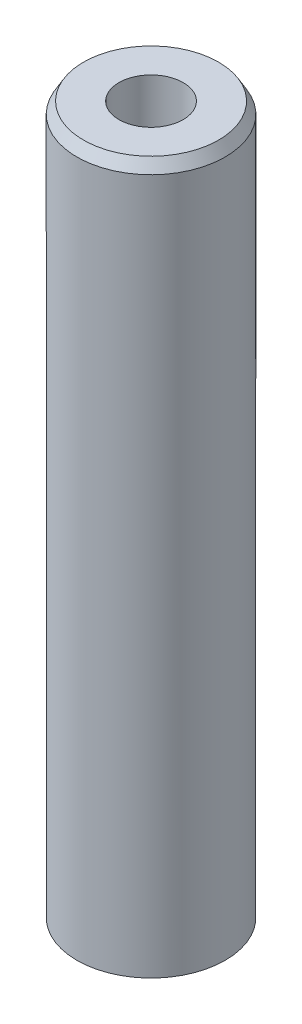
ISO-10303-21;
HEADER;
FILE_DESCRIPTION(('STEP AP214'),'2;1');
FILE_NAME('part.step','',(''),(''),'','','');
FILE_SCHEMA(('AUTOMOTIVE_DESIGN { 1 0 10303 214 1 1 1 1 }'));
ENDSEC;
DATA;
#1=APPLICATION_CONTEXT('core data for automotive mechanical design processes');
#2=APPLICATION_PROTOCOL_DEFINITION('international standard','automotive_design',2000,#1);
#3=PRODUCT_CONTEXT('',#1,'mechanical');
#4=PRODUCT('Part','Part','',(#3));
#5=PRODUCT_RELATED_PRODUCT_CATEGORY('part','',(#4));
#6=PRODUCT_DEFINITION_FORMATION('','',#4);
#7=PRODUCT_DEFINITION_CONTEXT('part definition',#1,'design');
#8=PRODUCT_DEFINITION('design','',#6,#7);
#9=PRODUCT_DEFINITION_SHAPE('','',#8);
#10=(LENGTH_UNIT() NAMED_UNIT(*) SI_UNIT(.MILLI.,.METRE.));
#11=(NAMED_UNIT(*) PLANE_ANGLE_UNIT() SI_UNIT($,.RADIAN.));
#12=(NAMED_UNIT(*) SI_UNIT($,.STERADIAN.) SOLID_ANGLE_UNIT());
#13=UNCERTAINTY_MEASURE_WITH_UNIT(LENGTH_MEASURE(1.E-05),#10,'distance_accuracy_value','');
#14=(GEOMETRIC_REPRESENTATION_CONTEXT(3) GLOBAL_UNCERTAINTY_ASSIGNED_CONTEXT((#13)) GLOBAL_UNIT_ASSIGNED_CONTEXT((#10,
#11,#12)) REPRESENTATION_CONTEXT('',''));
#15=CARTESIAN_POINT('',(0.,0.,0.));
#16=DIRECTION('',(0.,0.,1.));
#17=DIRECTION('',(1.,0.,0.));
#18=AXIS2_PLACEMENT_3D('',#15,#16,#17);
#19=CARTESIAN_POINT('',(0.,48.1345718786471,0.));
#20=DIRECTION('',(0.,-1.,0.));
#21=DIRECTION('',(0.,0.,-1.));
#22=AXIS2_PLACEMENT_3D('',#19,#20,#21);
#23=CYLINDRICAL_SURFACE('',#22,5.);
#24=CARTESIAN_POINT('',(0.,47.3669205132208,0.));
#25=DIRECTION('',(0.,1.,0.));
#26=DIRECTION('',(0.,0.,1.));
#27=AXIS2_PLACEMENT_3D('',#24,#25,#26);
#28=CIRCLE('',#27,5.);
#29=CARTESIAN_POINT('',(0.,47.3669205132208,-5.));
#30=VERTEX_POINT('',#29);
#31=EDGE_CURVE('E50',#30,#30,#28,.F.);
#32=ORIENTED_EDGE('',*,*,#31,.T.);
#33=EDGE_LOOP('',(#32));
#34=FACE_BOUND('',#33,.T.);
#35=CARTESIAN_POINT('',(0.,0.44320372247262,0.));
#36=DIRECTION('',(0.,1.,0.));
#37=DIRECTION('',(0.,0.,1.));
#38=AXIS2_PLACEMENT_3D('',#35,#36,#37);
#39=CIRCLE('',#38,5.);
#40=CARTESIAN_POINT('',(0.,0.44320372247262,5.));
#41=VERTEX_POINT('',#40);
#42=EDGE_CURVE('E51',#41,#41,#39,.T.);
#43=ORIENTED_EDGE('',*,*,#42,.T.);
#44=EDGE_LOOP('',(#43));
#45=FACE_BOUND('',#44,.T.);
#46=ADVANCED_FACE('F39',(#34,#45),#23,.T.);
#47=CARTESIAN_POINT('',(0.,48.1345718786471,0.));
#48=DIRECTION('',(0.,1.,0.));
#49=DIRECTION('',(0.,0.,1.));
#50=AXIS2_PLACEMENT_3D('',#47,#48,#49);
#51=PLANE('',#50);
#52=CARTESIAN_POINT('',(0.,48.1345718786471,0.));
#53=DIRECTION('',(0.,1.,0.));
#54=DIRECTION('',(0.,0.,1.));
#55=AXIS2_PLACEMENT_3D('',#52,#53,#54);
#56=CIRCLE('',#55,4.55679627752738);
#57=CARTESIAN_POINT('',(0.,48.1345718786471,-4.55679627752738));
#58=VERTEX_POINT('',#57);
#59=EDGE_CURVE('E54',#58,#58,#56,.T.);
#60=ORIENTED_EDGE('',*,*,#59,.T.);
#61=EDGE_LOOP('',(#60));
#62=FACE_BOUND('',#61,.T.);
#63=CARTESIAN_POINT('',(0.,48.1345718786471,0.));
#64=DIRECTION('',(0.,1.,0.));
#65=DIRECTION('',(0.,0.,1.));
#66=AXIS2_PLACEMENT_3D('',#63,#64,#65);
#67=CIRCLE('',#66,2.16621518925584);
#68=CARTESIAN_POINT('',(0.,48.1345718786471,2.16621518925584));
#69=VERTEX_POINT('',#68);
#70=EDGE_CURVE('E58',#69,#69,#67,.T.);
#71=ORIENTED_EDGE('',*,*,#70,.F.);
#72=EDGE_LOOP('',(#71));
#73=FACE_BOUND('',#72,.T.);
#74=ADVANCED_FACE('F69',(#62,#73),#51,.T.);
#75=CARTESIAN_POINT('',(0.,0.,0.));
#76=DIRECTION('',(0.,1.,0.));
#77=DIRECTION('',(0.,0.,1.));
#78=AXIS2_PLACEMENT_3D('',#75,#76,#77);
#79=PLANE('',#78);
#80=CARTESIAN_POINT('',(0.,0.,0.));
#81=DIRECTION('',(0.,1.,0.));
#82=DIRECTION('',(0.,0.,1.));
#83=AXIS2_PLACEMENT_3D('',#80,#81,#82);
#84=CIRCLE('',#83,4.23234863457376);
#85=CARTESIAN_POINT('',(0.,0.,4.23234863457376));
#86=VERTEX_POINT('',#85);
#87=EDGE_CURVE('E10',#86,#86,#84,.F.);
#88=ORIENTED_EDGE('',*,*,#87,.T.);
#89=EDGE_LOOP('',(#88));
#90=FACE_BOUND('',#89,.T.);
#91=CARTESIAN_POINT('',(0.,0.,0.));
#92=DIRECTION('',(0.,1.,0.));
#93=DIRECTION('',(0.,0.,1.));
#94=AXIS2_PLACEMENT_3D('',#91,#92,#93);
#95=CIRCLE('',#94,2.16621518925584);
#96=CARTESIAN_POINT('',(0.,0.,2.16621518925584));
#97=VERTEX_POINT('',#96);
#98=EDGE_CURVE('E63',#97,#97,#95,.T.);
#99=ORIENTED_EDGE('',*,*,#98,.T.);
#100=EDGE_LOOP('',(#99));
#101=FACE_BOUND('',#100,.T.);
#102=ADVANCED_FACE('F75',(#90,#101),#79,.F.);
#103=CARTESIAN_POINT('',(0.,48.1345718786471,0.));
#104=DIRECTION('',(0.,-1.,0.));
#105=DIRECTION('',(0.,0.,-1.));
#106=AXIS2_PLACEMENT_3D('',#103,#104,#105);
#107=CYLINDRICAL_SURFACE('',#106,2.16621518925584);
#108=ORIENTED_EDGE('',*,*,#70,.T.);
#109=EDGE_LOOP('',(#108));
#110=FACE_BOUND('',#109,.T.);
#111=ORIENTED_EDGE('',*,*,#98,.F.);
#112=EDGE_LOOP('',(#111));
#113=FACE_BOUND('',#112,.T.);
#114=ADVANCED_FACE('F70',(#110,#113),#107,.F.);
#115=CARTESIAN_POINT('',(0.,48.1345718786471,0.));
#116=DIRECTION('',(0.,-1.,0.));
#117=DIRECTION('',(0.,0.,-1.));
#118=AXIS2_PLACEMENT_3D('',#115,#116,#117);
#119=CONICAL_SURFACE('',#118,4.55679627752738,0.523598775598295);
#120=CARTESIAN_POINT('',(0.,47.3669205132208,-5.));
#121=CARTESIAN_POINT('',(0.,47.3749168816107,-4.99538329455758));
#122=CARTESIAN_POINT('',(0.,47.3829132500005,-4.99076658911516));
#123=CARTESIAN_POINT('',(0.,47.3989059867802,-4.98153317823031));
#124=CARTESIAN_POINT('',(0.,47.4069023551701,-4.97691647278789));
#125=CARTESIAN_POINT('',(0.,47.4228950919498,-4.96768306190304));
#126=CARTESIAN_POINT('',(0.,47.4308914603397,-4.96306635646062));
#127=CARTESIAN_POINT('',(0.,47.4468841971194,-4.95383294557577));
#128=CARTESIAN_POINT('',(0.,47.4548805655092,-4.94921624013335));
#129=CARTESIAN_POINT('',(0.,47.470873302289,-4.9399828292485));
#130=CARTESIAN_POINT('',(0.,47.4788696706788,-4.93536612380608));
#131=CARTESIAN_POINT('',(0.,47.4948624074585,-4.92613271292123));
#132=CARTESIAN_POINT('',(0.,47.5028587758484,-4.92151600747881));
#133=CARTESIAN_POINT('',(0.,47.5188515126281,-4.91228259659396));
#134=CARTESIAN_POINT('',(0.,47.5268478810179,-4.90766589115154));
#135=CARTESIAN_POINT('',(0.,47.5428406177977,-4.89843248026669));
#136=CARTESIAN_POINT('',(0.,47.5508369861875,-4.89381577482427));
#137=CARTESIAN_POINT('',(0.,47.5668297229672,-4.88458236393942));
#138=CARTESIAN_POINT('',(0.,47.5748260913571,-4.879965658497));
#139=CARTESIAN_POINT('',(0.,47.5908188281368,-4.87073224761216));
#140=CARTESIAN_POINT('',(0.,47.5988151965267,-4.86611554216973));
#141=CARTESIAN_POINT('',(0.,47.6148079333064,-4.85688213128489));
#142=CARTESIAN_POINT('',(0.,47.6228043016962,-4.85226542584246));
#143=CARTESIAN_POINT('',(0.,47.6387970384759,-4.84303201495762));
#144=CARTESIAN_POINT('',(0.,47.6467934068658,-4.83841530951519));
#145=CARTESIAN_POINT('',(0.,47.6627861436455,-4.82918189863035));
#146=CARTESIAN_POINT('',(0.,47.6707825120354,-4.82456519318792));
#147=CARTESIAN_POINT('',(0.,47.6867752488151,-4.81533178230308));
#148=CARTESIAN_POINT('',(0.,47.6947716172049,-4.81071507686065));
#149=CARTESIAN_POINT('',(0.,47.7107643539846,-4.80148166597581));
#150=CARTESIAN_POINT('',(0.,47.7187607223745,-4.79686496053338));
#151=CARTESIAN_POINT('',(0.,47.7347534591542,-4.78763154964854));
#152=CARTESIAN_POINT('',(0.,47.7427498275441,-4.78301484420612));
#153=CARTESIAN_POINT('',(0.,47.7587425643238,-4.77378143332127));
#154=CARTESIAN_POINT('',(0.,47.7667389327136,-4.76916472787885));
#155=CARTESIAN_POINT('',(0.,47.7827316694934,-4.759931316994));
#156=CARTESIAN_POINT('',(0.,47.7907280378832,-4.75531461155158));
#157=CARTESIAN_POINT('',(0.,47.8067207746629,-4.74608120066673));
#158=CARTESIAN_POINT('',(0.,47.8147171430528,-4.74146449522431));
#159=CARTESIAN_POINT('',(0.,47.8307098798325,-4.73223108433946));
#160=CARTESIAN_POINT('',(0.,47.8387062482224,-4.72761437889704));
#161=CARTESIAN_POINT('',(0.,47.8546989850021,-4.71838096801219));
#162=CARTESIAN_POINT('',(0.,47.8626953533919,-4.71376426256977));
#163=CARTESIAN_POINT('',(0.,47.8786880901716,-4.70453085168492));
#164=CARTESIAN_POINT('',(0.,47.8866844585615,-4.6999141462425));
#165=CARTESIAN_POINT('',(0.,47.9026771953412,-4.69068073535765));
#166=CARTESIAN_POINT('',(0.,47.9106735637311,-4.68606402991523));
#167=CARTESIAN_POINT('',(0.,47.9266663005108,-4.67683061903038));
#168=CARTESIAN_POINT('',(0.,47.9346626689006,-4.67221391358796));
#169=CARTESIAN_POINT('',(0.,47.9506554056803,-4.66298050270311));
#170=CARTESIAN_POINT('',(0.,47.9586517740702,-4.65836379726069));
#171=CARTESIAN_POINT('',(0.,47.9746445108499,-4.64913038637585));
#172=CARTESIAN_POINT('',(0.,47.9826408792398,-4.64451368093342));
#173=CARTESIAN_POINT('',(0.,47.9986336160195,-4.63528027004858));
#174=CARTESIAN_POINT('',(0.,48.0066299844093,-4.63066356460615));
#175=CARTESIAN_POINT('',(0.,48.0226227211891,-4.62143015372131));
#176=CARTESIAN_POINT('',(0.,48.0306190895789,-4.61681344827888));
#177=CARTESIAN_POINT('',(0.,48.0466118263586,-4.60758003739404));
#178=CARTESIAN_POINT('',(0.,48.0546081947485,-4.60296333195161));
#179=CARTESIAN_POINT('',(0.,48.0706009315282,-4.59372992106677));
#180=CARTESIAN_POINT('',(0.,48.0785972999181,-4.58911321562435));
#181=CARTESIAN_POINT('',(0.,48.0945900366978,-4.5798798047395));
#182=CARTESIAN_POINT('',(0.,48.1025864050876,-4.57526309929708));
#183=CARTESIAN_POINT('',(0.,48.1185791418673,-4.56602968841223));
#184=CARTESIAN_POINT('',(0.,48.1265755102572,-4.5614129829698));
#185=CARTESIAN_POINT('',(0.,48.1345718786471,-4.55679627752738));
#186=B_SPLINE_CURVE_WITH_KNOTS('',3,(#120,#121,#122,#123,#124,#125,#126,#127,#128,#129,#130,
#131,#132,#133,#134,#135,#136,#137,#138,#139,#140,#141,#142,#143,#144,#145,#146,#147,#148,#149,
#150,#151,#152,#153,#154,#155,#156,#157,#158,#159,#160,#161,#162,#163,#164,#165,#166,#167,#168,
#169,#170,#171,#172,#173,#174,#175,#176,#177,#178,#179,#180,#181,#182,#183,#184,#185),
.UNSPECIFIED.,.F.,.F.,(4,2,2,2,2,2,2,2,2,2,2,2,2,2,2,2,2,2,2,2,2,2,2,2,2,2,2,2,2,2,2,2,4),(0.,
0.0277002326545384,0.0554004653090768,0.0831006979636152,0.110800930618154,0.138501163272692,
0.166201395927231,0.193901628581769,0.221601861236308,0.249302093890846,0.277002326545385,
0.304702559199923,0.332402791854462,0.360103024509,0.387803257163539,0.415503489818077,
0.443203722472622,0.47090395512716,0.498604187781699,0.526304420436237,0.554004653090776,
0.581704885745314,0.609405118399853,0.637105351054391,0.66480558370893,0.692505816363468,
0.720206049018006,0.747906281672545,0.775606514327084,0.803306746981622,0.831006979636161,
0.858707212290699,0.886407444945244),.UNSPECIFIED.);
#187=EDGE_CURVE('BSEAM81',#30,#58,#186,.T.);
#188=ORIENTED_EDGE('',*,*,#31,.F.);
#189=ORIENTED_EDGE('',*,*,#59,.F.);
#190=ORIENTED_EDGE('',*,*,#187,.T.);
#191=ORIENTED_EDGE('',*,*,#187,.F.);
#192=EDGE_LOOP('',(#188,#190,#189,#191));
#193=FACE_BOUND('',#192,.T.);
#194=ADVANCED_FACE('F81',(#193),#119,.T.);
#195=CARTESIAN_POINT('',(0.,0.44320372247262,0.));
#196=DIRECTION('',(0.,1.,0.));
#197=DIRECTION('',(0.,0.,1.));
#198=AXIS2_PLACEMENT_3D('',#195,#196,#197);
#199=CONICAL_SURFACE('',#198,5.,1.0471975511966);
#200=ORIENTED_EDGE('',*,*,#87,.F.);
#201=EDGE_LOOP('',(#200));
#202=FACE_BOUND('',#201,.T.);
#203=ORIENTED_EDGE('',*,*,#42,.F.);
#204=EDGE_LOOP('',(#203));
#205=FACE_BOUND('',#204,.T.);
#206=ADVANCED_FACE('F45',(#202,#205),#199,.T.);
#207=CLOSED_SHELL('',(#46,#74,#102,#114,#194,#206));
#208=MANIFOLD_SOLID_BREP('B2',#207);
#209=ADVANCED_BREP_SHAPE_REPRESENTATION('',(#18,#208),#14);
#210=SHAPE_DEFINITION_REPRESENTATION(#9,#209);
ENDSEC;
END-ISO-10303-21;
